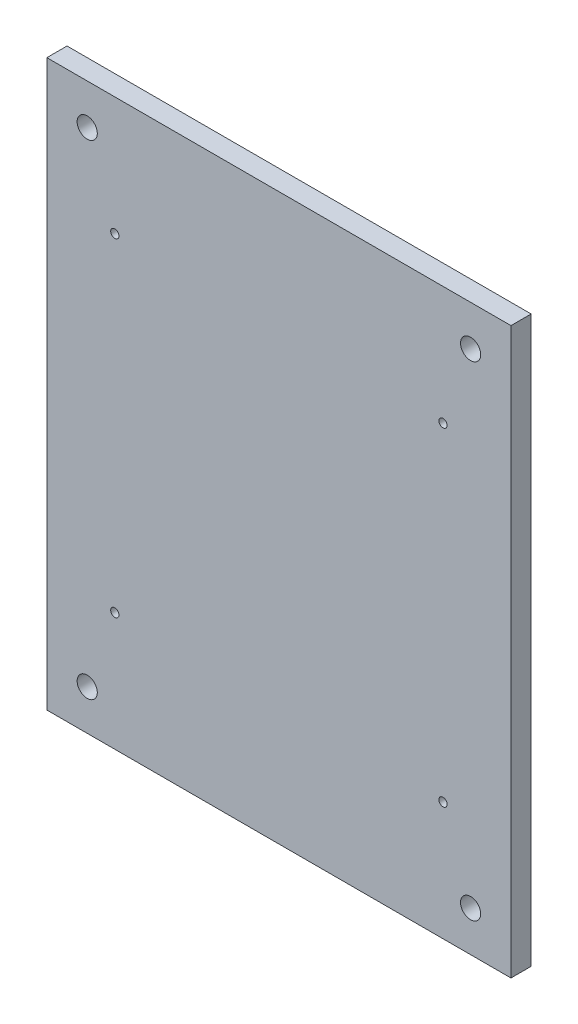
ISO-10303-21;
HEADER;
FILE_DESCRIPTION(('STEP AP214'),'2;1');
FILE_NAME('part.step','',(''),(''),'','','');
FILE_SCHEMA(('AUTOMOTIVE_DESIGN { 1 0 10303 214 1 1 1 1 }'));
ENDSEC;
DATA;
#1=APPLICATION_CONTEXT('core data for automotive mechanical design processes');
#2=APPLICATION_PROTOCOL_DEFINITION('international standard','automotive_design',2000,#1);
#3=PRODUCT_CONTEXT('',#1,'mechanical');
#4=PRODUCT('Part','Part','',(#3));
#5=PRODUCT_RELATED_PRODUCT_CATEGORY('part','',(#4));
#6=PRODUCT_DEFINITION_FORMATION('','',#4);
#7=PRODUCT_DEFINITION_CONTEXT('part definition',#1,'design');
#8=PRODUCT_DEFINITION('design','',#6,#7);
#9=PRODUCT_DEFINITION_SHAPE('','',#8);
#10=(LENGTH_UNIT() NAMED_UNIT(*) SI_UNIT(.MILLI.,.METRE.));
#11=(NAMED_UNIT(*) PLANE_ANGLE_UNIT() SI_UNIT($,.RADIAN.));
#12=(NAMED_UNIT(*) SI_UNIT($,.STERADIAN.) SOLID_ANGLE_UNIT());
#13=UNCERTAINTY_MEASURE_WITH_UNIT(LENGTH_MEASURE(1.E-05),#10,'distance_accuracy_value','');
#14=(GEOMETRIC_REPRESENTATION_CONTEXT(3) GLOBAL_UNCERTAINTY_ASSIGNED_CONTEXT((#13)) GLOBAL_UNIT_ASSIGNED_CONTEXT((#10,
#11,#12)) REPRESENTATION_CONTEXT('',''));
#15=CARTESIAN_POINT('',(0.,0.,0.));
#16=DIRECTION('',(0.,0.,1.));
#17=DIRECTION('',(1.,0.,0.));
#18=AXIS2_PLACEMENT_3D('',#15,#16,#17);
#19=CARTESIAN_POINT('',(4.,4.,0.));
#20=DIRECTION('',(0.,0.,-1.));
#21=DIRECTION('',(-1.,0.,0.));
#22=AXIS2_PLACEMENT_3D('',#19,#20,#21);
#23=PLANE('',#22);
#24=CARTESIAN_POINT('',(6.59000000000001,6.59,0.));
#25=DIRECTION('',(0.,0.,1.));
#26=DIRECTION('',(1.,0.,0.));
#27=AXIS2_PLACEMENT_3D('',#24,#25,#26);
#28=CIRCLE('',#27,1.025);
#29=CARTESIAN_POINT('',(7.61500000000001,6.59,0.));
#30=VERTEX_POINT('',#29);
#31=EDGE_CURVE('E225',#30,#30,#28,.T.);
#32=ORIENTED_EDGE('',*,*,#31,.T.);
#33=EDGE_LOOP('',(#32));
#34=FACE_BOUND('',#33,.T.);
#35=CARTESIAN_POINT('',(6.59000000000001,87.91,0.));
#36=DIRECTION('',(0.,0.,1.));
#37=DIRECTION('',(1.,0.,0.));
#38=AXIS2_PLACEMENT_3D('',#35,#36,#37);
#39=CIRCLE('',#38,1.025);
#40=CARTESIAN_POINT('',(7.61500000000001,87.91,0.));
#41=VERTEX_POINT('',#40);
#42=EDGE_CURVE('E169',#41,#41,#39,.T.);
#43=ORIENTED_EDGE('',*,*,#42,.T.);
#44=EDGE_LOOP('',(#43));
#45=FACE_BOUND('',#44,.T.);
#46=CARTESIAN_POINT('',(4.,4.,0.));
#47=DIRECTION('',(0.,0.,1.));
#48=DIRECTION('',(-1.,0.,0.));
#49=AXIS2_PLACEMENT_3D('',#46,#47,#48);
#50=CIRCLE('',#49,4.);
#51=CARTESIAN_POINT('',(0.,4.00000000000003,0.));
#52=VERTEX_POINT('',#51);
#53=CARTESIAN_POINT('',(4.00000000000003,0.,0.));
#54=VERTEX_POINT('',#53);
#55=EDGE_CURVE('E164',#52,#54,#50,.T.);
#56=ORIENTED_EDGE('',*,*,#55,.F.);
#57=DIRECTION('',(0.,-1.,0.));
#58=VECTOR('',#57,1.);
#59=CARTESIAN_POINT('',(0.,4.00000000000003,0.));
#60=LINE('',#59,#58);
#61=CARTESIAN_POINT('',(0.,90.5,0.));
#62=VERTEX_POINT('',#61);
#63=EDGE_CURVE('E99',#62,#52,#60,.T.);
#64=ORIENTED_EDGE('',*,*,#63,.F.);
#65=CARTESIAN_POINT('',(4.,90.5,0.));
#66=DIRECTION('',(0.,0.,1.));
#67=DIRECTION('',(-1.,0.,0.));
#68=AXIS2_PLACEMENT_3D('',#65,#66,#67);
#69=CIRCLE('',#68,4.);
#70=CARTESIAN_POINT('',(4.00000000000003,94.5,0.));
#71=VERTEX_POINT('',#70);
#72=EDGE_CURVE('E93',#71,#62,#69,.T.);
#73=ORIENTED_EDGE('',*,*,#72,.F.);
#74=DIRECTION('',(-1.,0.,0.));
#75=VECTOR('',#74,1.);
#76=CARTESIAN_POINT('',(4.00000000000003,94.5,0.));
#77=LINE('',#76,#75);
#78=CARTESIAN_POINT('',(90.5,94.5,0.));
#79=VERTEX_POINT('',#78);
#80=EDGE_CURVE('E180',#79,#71,#77,.T.);
#81=ORIENTED_EDGE('',*,*,#80,.F.);
#82=CARTESIAN_POINT('',(90.5,90.5,0.));
#83=DIRECTION('',(0.,0.,1.));
#84=DIRECTION('',(-1.,0.,0.));
#85=AXIS2_PLACEMENT_3D('',#82,#83,#84);
#86=CIRCLE('',#85,4.);
#87=CARTESIAN_POINT('',(94.5,90.5,0.));
#88=VERTEX_POINT('',#87);
#89=EDGE_CURVE('E130',#88,#79,#86,.T.);
#90=ORIENTED_EDGE('',*,*,#89,.F.);
#91=DIRECTION('',(0.,1.,0.));
#92=VECTOR('',#91,1.);
#93=CARTESIAN_POINT('',(94.5,4.00000000000003,0.));
#94=LINE('',#93,#92);
#95=CARTESIAN_POINT('',(94.5,4.,0.));
#96=VERTEX_POINT('',#95);
#97=EDGE_CURVE('E175',#96,#88,#94,.T.);
#98=ORIENTED_EDGE('',*,*,#97,.F.);
#99=CARTESIAN_POINT('',(90.5,4.,0.));
#100=DIRECTION('',(0.,0.,1.));
#101=DIRECTION('',(1.,0.,0.));
#102=AXIS2_PLACEMENT_3D('',#99,#100,#101);
#103=CIRCLE('',#102,4.);
#104=CARTESIAN_POINT('',(90.5,0.,0.));
#105=VERTEX_POINT('',#104);
#106=EDGE_CURVE('E172',#105,#96,#103,.T.);
#107=ORIENTED_EDGE('',*,*,#106,.F.);
#108=DIRECTION('',(1.,0.,0.));
#109=VECTOR('',#108,1.);
#110=CARTESIAN_POINT('',(4.00000000000003,0.,0.));
#111=LINE('',#110,#109);
#112=EDGE_CURVE('E168',#54,#105,#111,.T.);
#113=ORIENTED_EDGE('',*,*,#112,.F.);
#114=EDGE_LOOP('',(#56,#64,#73,#81,#90,#98,#107,#113));
#115=FACE_BOUND('',#114,.T.);
#116=CARTESIAN_POINT('',(87.91,87.91,0.));
#117=DIRECTION('',(0.,0.,1.));
#118=DIRECTION('',(1.,0.,0.));
#119=AXIS2_PLACEMENT_3D('',#116,#117,#118);
#120=CIRCLE('',#119,1.025);
#121=CARTESIAN_POINT('',(88.935,87.91,0.));
#122=VERTEX_POINT('',#121);
#123=EDGE_CURVE('E221',#122,#122,#120,.T.);
#124=ORIENTED_EDGE('',*,*,#123,.T.);
#125=EDGE_LOOP('',(#124));
#126=FACE_BOUND('',#125,.T.);
#127=CARTESIAN_POINT('',(87.91,6.59,0.));
#128=DIRECTION('',(0.,0.,1.));
#129=DIRECTION('',(1.,0.,0.));
#130=AXIS2_PLACEMENT_3D('',#127,#128,#129);
#131=CIRCLE('',#130,1.025);
#132=CARTESIAN_POINT('',(88.935,6.59,0.));
#133=VERTEX_POINT('',#132);
#134=EDGE_CURVE('E229',#133,#133,#131,.T.);
#135=ORIENTED_EDGE('',*,*,#134,.T.);
#136=EDGE_LOOP('',(#135));
#137=FACE_BOUND('',#136,.T.);
#138=ADVANCED_FACE('F47',(#34,#45,#115,#126,#137),#23,.T.);
#139=CARTESIAN_POINT('',(4.,4.,5.));
#140=DIRECTION('',(0.,0.,-1.));
#141=DIRECTION('',(-1.,0.,0.));
#142=AXIS2_PLACEMENT_3D('',#139,#140,#141);
#143=CYLINDRICAL_SURFACE('',#142,4.);
#144=ORIENTED_EDGE('',*,*,#55,.T.);
#145=DIRECTION('',(0.,0.,-1.));
#146=VECTOR('',#145,1.);
#147=CARTESIAN_POINT('',(4.00000000000003,0.,5.));
#148=LINE('',#147,#146);
#149=CARTESIAN_POINT('',(4.00000000000003,0.,5.));
#150=VERTEX_POINT('',#149);
#151=EDGE_CURVE('E12',#150,#54,#148,.T.);
#152=ORIENTED_EDGE('',*,*,#151,.F.);
#153=CARTESIAN_POINT('',(4.,4.,5.));
#154=DIRECTION('',(0.,0.,1.));
#155=DIRECTION('',(-1.,0.,0.));
#156=AXIS2_PLACEMENT_3D('',#153,#154,#155);
#157=CIRCLE('',#156,4.);
#158=CARTESIAN_POINT('',(0.,4.00000000000003,5.));
#159=VERTEX_POINT('',#158);
#160=EDGE_CURVE('E187',#159,#150,#157,.T.);
#161=ORIENTED_EDGE('',*,*,#160,.F.);
#162=DIRECTION('',(0.,0.,-1.));
#163=VECTOR('',#162,1.);
#164=CARTESIAN_POINT('',(0.,4.00000000000003,5.));
#165=LINE('',#164,#163);
#166=EDGE_CURVE('E163',#159,#52,#165,.T.);
#167=ORIENTED_EDGE('',*,*,#166,.T.);
#168=EDGE_LOOP('',(#144,#152,#161,#167));
#169=FACE_BOUND('',#168,.T.);
#170=ADVANCED_FACE('F49',(#169),#143,.T.);
#171=CARTESIAN_POINT('',(4.00000000000003,0.,5.));
#172=DIRECTION('',(0.,1.,0.));
#173=DIRECTION('',(0.,0.,1.));
#174=AXIS2_PLACEMENT_3D('',#171,#172,#173);
#175=PLANE('',#174);
#176=ORIENTED_EDGE('',*,*,#112,.T.);
#177=DIRECTION('',(0.,0.,-1.));
#178=VECTOR('',#177,1.);
#179=CARTESIAN_POINT('',(90.5,0.,5.));
#180=LINE('',#179,#178);
#181=CARTESIAN_POINT('',(90.5,0.,5.));
#182=VERTEX_POINT('',#181);
#183=EDGE_CURVE('E57',#182,#105,#180,.T.);
#184=ORIENTED_EDGE('',*,*,#183,.F.);
#185=DIRECTION('',(1.,0.,0.));
#186=VECTOR('',#185,1.);
#187=CARTESIAN_POINT('',(4.00000000000003,0.,5.));
#188=LINE('',#187,#186);
#189=EDGE_CURVE('E107',#150,#182,#188,.T.);
#190=ORIENTED_EDGE('',*,*,#189,.F.);
#191=ORIENTED_EDGE('',*,*,#151,.T.);
#192=EDGE_LOOP('',(#176,#184,#190,#191));
#193=FACE_BOUND('',#192,.T.);
#194=ADVANCED_FACE('F376',(#193),#175,.F.);
#195=CARTESIAN_POINT('',(90.5,4.,5.));
#196=DIRECTION('',(0.,0.,-1.));
#197=DIRECTION('',(-1.,0.,0.));
#198=AXIS2_PLACEMENT_3D('',#195,#196,#197);
#199=CYLINDRICAL_SURFACE('',#198,4.);
#200=ORIENTED_EDGE('',*,*,#106,.T.);
#201=DIRECTION('',(0.,0.,-1.));
#202=VECTOR('',#201,1.);
#203=CARTESIAN_POINT('',(94.5,4.,5.));
#204=LINE('',#203,#202);
#205=CARTESIAN_POINT('',(94.5,4.,5.));
#206=VERTEX_POINT('',#205);
#207=EDGE_CURVE('E196',#206,#96,#204,.T.);
#208=ORIENTED_EDGE('',*,*,#207,.F.);
#209=CARTESIAN_POINT('',(90.5,4.,5.));
#210=DIRECTION('',(0.,0.,1.));
#211=DIRECTION('',(1.,0.,0.));
#212=AXIS2_PLACEMENT_3D('',#209,#210,#211);
#213=CIRCLE('',#212,4.);
#214=EDGE_CURVE('E154',#182,#206,#213,.T.);
#215=ORIENTED_EDGE('',*,*,#214,.F.);
#216=ORIENTED_EDGE('',*,*,#183,.T.);
#217=EDGE_LOOP('',(#200,#208,#215,#216));
#218=FACE_BOUND('',#217,.T.);
#219=ADVANCED_FACE('F204',(#218),#199,.T.);
#220=CARTESIAN_POINT('',(94.5,4.00000000000003,5.));
#221=DIRECTION('',(-1.,0.,0.));
#222=DIRECTION('',(0.,0.,1.));
#223=AXIS2_PLACEMENT_3D('',#220,#221,#222);
#224=PLANE('',#223);
#225=ORIENTED_EDGE('',*,*,#97,.T.);
#226=DIRECTION('',(0.,0.,-1.));
#227=VECTOR('',#226,1.);
#228=CARTESIAN_POINT('',(94.5,90.5,5.));
#229=LINE('',#228,#227);
#230=CARTESIAN_POINT('',(94.5,90.5,5.));
#231=VERTEX_POINT('',#230);
#232=EDGE_CURVE('E134',#231,#88,#229,.T.);
#233=ORIENTED_EDGE('',*,*,#232,.F.);
#234=DIRECTION('',(0.,1.,0.));
#235=VECTOR('',#234,1.);
#236=CARTESIAN_POINT('',(94.5,4.00000000000003,5.));
#237=LINE('',#236,#235);
#238=EDGE_CURVE('E150',#206,#231,#237,.T.);
#239=ORIENTED_EDGE('',*,*,#238,.F.);
#240=ORIENTED_EDGE('',*,*,#207,.T.);
#241=EDGE_LOOP('',(#225,#233,#239,#240));
#242=FACE_BOUND('',#241,.T.);
#243=ADVANCED_FACE('F210',(#242),#224,.F.);
#244=CARTESIAN_POINT('',(90.5,90.5,5.));
#245=DIRECTION('',(0.,0.,-1.));
#246=DIRECTION('',(-1.,0.,0.));
#247=AXIS2_PLACEMENT_3D('',#244,#245,#246);
#248=CYLINDRICAL_SURFACE('',#247,4.);
#249=ORIENTED_EDGE('',*,*,#89,.T.);
#250=DIRECTION('',(0.,0.,-1.));
#251=VECTOR('',#250,1.);
#252=CARTESIAN_POINT('',(90.5,94.5,5.));
#253=LINE('',#252,#251);
#254=CARTESIAN_POINT('',(90.5,94.5,5.));
#255=VERTEX_POINT('',#254);
#256=EDGE_CURVE('E122',#255,#79,#253,.T.);
#257=ORIENTED_EDGE('',*,*,#256,.F.);
#258=CARTESIAN_POINT('',(90.5,90.5,5.));
#259=DIRECTION('',(0.,0.,1.));
#260=DIRECTION('',(-1.,0.,0.));
#261=AXIS2_PLACEMENT_3D('',#258,#259,#260);
#262=CIRCLE('',#261,4.);
#263=EDGE_CURVE('E127',#231,#255,#262,.T.);
#264=ORIENTED_EDGE('',*,*,#263,.F.);
#265=ORIENTED_EDGE('',*,*,#232,.T.);
#266=EDGE_LOOP('',(#249,#257,#264,#265));
#267=FACE_BOUND('',#266,.T.);
#268=ADVANCED_FACE('F124',(#267),#248,.T.);
#269=CARTESIAN_POINT('',(4.00000000000003,94.5,5.));
#270=DIRECTION('',(0.,-1.,0.));
#271=DIRECTION('',(0.,0.,-1.));
#272=AXIS2_PLACEMENT_3D('',#269,#270,#271);
#273=PLANE('',#272);
#274=ORIENTED_EDGE('',*,*,#80,.T.);
#275=DIRECTION('',(0.,0.,-1.));
#276=VECTOR('',#275,1.);
#277=CARTESIAN_POINT('',(4.00000000000003,94.5,5.));
#278=LINE('',#277,#276);
#279=CARTESIAN_POINT('',(4.00000000000003,94.5,5.));
#280=VERTEX_POINT('',#279);
#281=EDGE_CURVE('E135',#280,#71,#278,.T.);
#282=ORIENTED_EDGE('',*,*,#281,.F.);
#283=DIRECTION('',(-1.,0.,0.));
#284=VECTOR('',#283,1.);
#285=CARTESIAN_POINT('',(4.00000000000003,94.5,5.));
#286=LINE('',#285,#284);
#287=EDGE_CURVE('E138',#255,#280,#286,.T.);
#288=ORIENTED_EDGE('',*,*,#287,.F.);
#289=ORIENTED_EDGE('',*,*,#256,.T.);
#290=EDGE_LOOP('',(#274,#282,#288,#289));
#291=FACE_BOUND('',#290,.T.);
#292=ADVANCED_FACE('F139',(#291),#273,.F.);
#293=CARTESIAN_POINT('',(4.,90.5,5.));
#294=DIRECTION('',(0.,0.,-1.));
#295=DIRECTION('',(-1.,0.,0.));
#296=AXIS2_PLACEMENT_3D('',#293,#294,#295);
#297=CYLINDRICAL_SURFACE('',#296,4.);
#298=ORIENTED_EDGE('',*,*,#72,.T.);
#299=DIRECTION('',(0.,0.,-1.));
#300=VECTOR('',#299,1.);
#301=CARTESIAN_POINT('',(0.,90.5,5.));
#302=LINE('',#301,#300);
#303=CARTESIAN_POINT('',(0.,90.5,5.));
#304=VERTEX_POINT('',#303);
#305=EDGE_CURVE('E65',#304,#62,#302,.T.);
#306=ORIENTED_EDGE('',*,*,#305,.F.);
#307=CARTESIAN_POINT('',(4.,90.5,5.));
#308=DIRECTION('',(0.,0.,1.));
#309=DIRECTION('',(-1.,0.,0.));
#310=AXIS2_PLACEMENT_3D('',#307,#308,#309);
#311=CIRCLE('',#310,4.);
#312=EDGE_CURVE('E143',#280,#304,#311,.T.);
#313=ORIENTED_EDGE('',*,*,#312,.F.);
#314=ORIENTED_EDGE('',*,*,#281,.T.);
#315=EDGE_LOOP('',(#298,#306,#313,#314));
#316=FACE_BOUND('',#315,.T.);
#317=ADVANCED_FACE('F385',(#316),#297,.T.);
#318=CARTESIAN_POINT('',(0.,4.00000000000003,5.));
#319=DIRECTION('',(1.,0.,0.));
#320=DIRECTION('',(0.,0.,-1.));
#321=AXIS2_PLACEMENT_3D('',#318,#319,#320);
#322=PLANE('',#321);
#323=ORIENTED_EDGE('',*,*,#63,.T.);
#324=ORIENTED_EDGE('',*,*,#166,.F.);
#325=DIRECTION('',(0.,-1.,0.));
#326=VECTOR('',#325,1.);
#327=CARTESIAN_POINT('',(0.,4.00000000000003,5.));
#328=LINE('',#327,#326);
#329=EDGE_CURVE('E160',#304,#159,#328,.T.);
#330=ORIENTED_EDGE('',*,*,#329,.F.);
#331=ORIENTED_EDGE('',*,*,#305,.T.);
#332=EDGE_LOOP('',(#323,#324,#330,#331));
#333=FACE_BOUND('',#332,.T.);
#334=ADVANCED_FACE('F383',(#333),#322,.F.);
#335=CARTESIAN_POINT('',(6.59000000000001,87.91,5.));
#336=DIRECTION('',(0.,0.,-1.));
#337=DIRECTION('',(-1.,0.,0.));
#338=AXIS2_PLACEMENT_3D('',#335,#336,#337);
#339=CYLINDRICAL_SURFACE('',#338,1.025);
#340=ORIENTED_EDGE('',*,*,#42,.F.);
#341=EDGE_LOOP('',(#340));
#342=FACE_BOUND('',#341,.T.);
#343=CARTESIAN_POINT('',(6.59000000000001,87.91,10.));
#344=DIRECTION('',(0.,0.,1.));
#345=DIRECTION('',(1.,0.,0.));
#346=AXIS2_PLACEMENT_3D('',#343,#344,#345);
#347=CIRCLE('',#346,1.025);
#348=CARTESIAN_POINT('',(7.61500000000001,87.91,10.));
#349=VERTEX_POINT('',#348);
#350=EDGE_CURVE('E322',#349,#349,#347,.T.);
#351=ORIENTED_EDGE('',*,*,#350,.T.);
#352=EDGE_LOOP('',(#351));
#353=FACE_BOUND('',#352,.T.);
#354=ADVANCED_FACE('F381',(#342,#353),#339,.F.);
#355=CARTESIAN_POINT('',(87.91,87.91,5.));
#356=DIRECTION('',(0.,0.,-1.));
#357=DIRECTION('',(-1.,0.,0.));
#358=AXIS2_PLACEMENT_3D('',#355,#356,#357);
#359=CYLINDRICAL_SURFACE('',#358,1.025);
#360=ORIENTED_EDGE('',*,*,#123,.F.);
#361=EDGE_LOOP('',(#360));
#362=FACE_BOUND('',#361,.T.);
#363=CARTESIAN_POINT('',(87.91,87.91,10.));
#364=DIRECTION('',(0.,0.,1.));
#365=DIRECTION('',(1.,0.,0.));
#366=AXIS2_PLACEMENT_3D('',#363,#364,#365);
#367=CIRCLE('',#366,1.025);
#368=CARTESIAN_POINT('',(88.935,87.91,10.));
#369=VERTEX_POINT('',#368);
#370=EDGE_CURVE('E318',#369,#369,#367,.T.);
#371=ORIENTED_EDGE('',*,*,#370,.T.);
#372=EDGE_LOOP('',(#371));
#373=FACE_BOUND('',#372,.T.);
#374=ADVANCED_FACE('F463',(#362,#373),#359,.F.);
#375=CARTESIAN_POINT('',(6.59000000000001,6.59,5.));
#376=DIRECTION('',(0.,0.,-1.));
#377=DIRECTION('',(-1.,0.,0.));
#378=AXIS2_PLACEMENT_3D('',#375,#376,#377);
#379=CYLINDRICAL_SURFACE('',#378,1.025);
#380=ORIENTED_EDGE('',*,*,#31,.F.);
#381=EDGE_LOOP('',(#380));
#382=FACE_BOUND('',#381,.T.);
#383=CARTESIAN_POINT('',(6.59000000000001,6.59,10.));
#384=DIRECTION('',(0.,0.,1.));
#385=DIRECTION('',(1.,0.,0.));
#386=AXIS2_PLACEMENT_3D('',#383,#384,#385);
#387=CIRCLE('',#386,1.025);
#388=CARTESIAN_POINT('',(7.61500000000001,6.59,10.));
#389=VERTEX_POINT('',#388);
#390=EDGE_CURVE('E317',#389,#389,#387,.T.);
#391=ORIENTED_EDGE('',*,*,#390,.T.);
#392=EDGE_LOOP('',(#391));
#393=FACE_BOUND('',#392,.T.);
#394=ADVANCED_FACE('F330',(#382,#393),#379,.F.);
#395=CARTESIAN_POINT('',(87.91,6.59,5.));
#396=DIRECTION('',(0.,0.,-1.));
#397=DIRECTION('',(-1.,0.,0.));
#398=AXIS2_PLACEMENT_3D('',#395,#396,#397);
#399=CYLINDRICAL_SURFACE('',#398,1.025);
#400=ORIENTED_EDGE('',*,*,#134,.F.);
#401=EDGE_LOOP('',(#400));
#402=FACE_BOUND('',#401,.T.);
#403=CARTESIAN_POINT('',(87.91,6.59,10.));
#404=DIRECTION('',(0.,0.,1.));
#405=DIRECTION('',(1.,0.,0.));
#406=AXIS2_PLACEMENT_3D('',#403,#404,#405);
#407=CIRCLE('',#406,1.025);
#408=CARTESIAN_POINT('',(88.935,6.59,10.));
#409=VERTEX_POINT('',#408);
#410=EDGE_CURVE('E310',#409,#409,#407,.T.);
#411=ORIENTED_EDGE('',*,*,#410,.T.);
#412=EDGE_LOOP('',(#411));
#413=FACE_BOUND('',#412,.T.);
#414=ADVANCED_FACE('F335',(#402,#413),#399,.F.);
#415=CARTESIAN_POINT('',(0.,0.,10.));
#416=DIRECTION('',(0.,0.,1.));
#417=DIRECTION('',(1.,0.,0.));
#418=AXIS2_PLACEMENT_3D('',#415,#416,#417);
#419=PLANE('',#418);
#420=ORIENTED_EDGE('',*,*,#370,.F.);
#421=EDGE_LOOP('',(#420));
#422=FACE_BOUND('',#421,.T.);
#423=ORIENTED_EDGE('',*,*,#350,.F.);
#424=EDGE_LOOP('',(#423));
#425=FACE_BOUND('',#424,.T.);
#426=ORIENTED_EDGE('',*,*,#390,.F.);
#427=EDGE_LOOP('',(#426));
#428=FACE_BOUND('',#427,.T.);
#429=ORIENTED_EDGE('',*,*,#410,.F.);
#430=EDGE_LOOP('',(#429));
#431=FACE_BOUND('',#430,.T.);
#432=CARTESIAN_POINT('',(-0.249999999999968,107.25,10.));
#433=DIRECTION('',(0.,0.,1.));
#434=DIRECTION('',(1.,0.,0.));
#435=AXIS2_PLACEMENT_3D('',#432,#433,#434);
#436=CIRCLE('',#435,2.50000000000001);
#437=CARTESIAN_POINT('',(2.25000000000004,107.25,10.));
#438=VERTEX_POINT('',#437);
#439=EDGE_CURVE('E294',#438,#438,#436,.T.);
#440=ORIENTED_EDGE('',*,*,#439,.F.);
#441=EDGE_LOOP('',(#440));
#442=FACE_BOUND('',#441,.T.);
#443=CARTESIAN_POINT('',(94.75,107.25,10.));
#444=DIRECTION('',(0.,0.,1.));
#445=DIRECTION('',(1.,0.,0.));
#446=AXIS2_PLACEMENT_3D('',#443,#444,#445);
#447=CIRCLE('',#446,2.50000000000001);
#448=CARTESIAN_POINT('',(97.25,107.25,10.));
#449=VERTEX_POINT('',#448);
#450=EDGE_CURVE('E267',#449,#449,#447,.T.);
#451=ORIENTED_EDGE('',*,*,#450,.F.);
#452=EDGE_LOOP('',(#451));
#453=FACE_BOUND('',#452,.T.);
#454=DIRECTION('',(0.,-1.,0.));
#455=VECTOR('',#454,1.);
#456=CARTESIAN_POINT('',(-10.25,117.25,10.));
#457=LINE('',#456,#455);
#458=CARTESIAN_POINT('',(-10.25,117.25,10.));
#459=VERTEX_POINT('',#458);
#460=CARTESIAN_POINT('',(-10.25,-22.75,10.));
#461=VERTEX_POINT('',#460);
#462=EDGE_CURVE('E254',#459,#461,#457,.T.);
#463=ORIENTED_EDGE('',*,*,#462,.T.);
#464=DIRECTION('',(1.,0.,0.));
#465=VECTOR('',#464,1.);
#466=CARTESIAN_POINT('',(-10.25,-22.75,10.));
#467=LINE('',#466,#465);
#468=CARTESIAN_POINT('',(104.75,-22.75,10.));
#469=VERTEX_POINT('',#468);
#470=EDGE_CURVE('E275',#461,#469,#467,.T.);
#471=ORIENTED_EDGE('',*,*,#470,.T.);
#472=DIRECTION('',(0.,1.,0.));
#473=VECTOR('',#472,1.);
#474=CARTESIAN_POINT('',(104.75,117.25,10.));
#475=LINE('',#474,#473);
#476=CARTESIAN_POINT('',(104.75,117.25,10.));
#477=VERTEX_POINT('',#476);
#478=EDGE_CURVE('E271',#469,#477,#475,.T.);
#479=ORIENTED_EDGE('',*,*,#478,.T.);
#480=DIRECTION('',(-1.,0.,0.));
#481=VECTOR('',#480,1.);
#482=CARTESIAN_POINT('',(-10.25,117.25,10.));
#483=LINE('',#482,#481);
#484=EDGE_CURVE('E249',#477,#459,#483,.T.);
#485=ORIENTED_EDGE('',*,*,#484,.T.);
#486=EDGE_LOOP('',(#463,#471,#479,#485));
#487=FACE_BOUND('',#486,.T.);
#488=CARTESIAN_POINT('',(94.75,-12.75,10.));
#489=DIRECTION('',(0.,0.,1.));
#490=DIRECTION('',(1.,0.,0.));
#491=AXIS2_PLACEMENT_3D('',#488,#489,#490);
#492=CIRCLE('',#491,2.5);
#493=CARTESIAN_POINT('',(97.25,-12.75,10.));
#494=VERTEX_POINT('',#493);
#495=EDGE_CURVE('E286',#494,#494,#492,.T.);
#496=ORIENTED_EDGE('',*,*,#495,.F.);
#497=EDGE_LOOP('',(#496));
#498=FACE_BOUND('',#497,.T.);
#499=CARTESIAN_POINT('',(-0.24999999999999,-12.75,10.));
#500=DIRECTION('',(0.,0.,1.));
#501=DIRECTION('',(1.,0.,0.));
#502=AXIS2_PLACEMENT_3D('',#499,#500,#501);
#503=CIRCLE('',#502,2.50000000000001);
#504=CARTESIAN_POINT('',(2.25000000000002,-12.75,10.));
#505=VERTEX_POINT('',#504);
#506=EDGE_CURVE('E302',#505,#505,#503,.T.);
#507=ORIENTED_EDGE('',*,*,#506,.F.);
#508=EDGE_LOOP('',(#507));
#509=FACE_BOUND('',#508,.T.);
#510=ADVANCED_FACE('F332',(#422,#425,#428,#431,#442,#453,#487,#498,#509),#419,.T.);
#511=CARTESIAN_POINT('',(0.,0.,5.));
#512=DIRECTION('',(0.,0.,1.));
#513=DIRECTION('',(1.,0.,0.));
#514=AXIS2_PLACEMENT_3D('',#511,#512,#513);
#515=PLANE('',#514);
#516=ORIENTED_EDGE('',*,*,#329,.T.);
#517=ORIENTED_EDGE('',*,*,#160,.T.);
#518=ORIENTED_EDGE('',*,*,#189,.T.);
#519=ORIENTED_EDGE('',*,*,#214,.T.);
#520=ORIENTED_EDGE('',*,*,#238,.T.);
#521=ORIENTED_EDGE('',*,*,#263,.T.);
#522=ORIENTED_EDGE('',*,*,#287,.T.);
#523=ORIENTED_EDGE('',*,*,#312,.T.);
#524=EDGE_LOOP('',(#516,#517,#518,#519,#520,#521,#522,#523));
#525=FACE_BOUND('',#524,.T.);
#526=DIRECTION('',(0.,-1.,0.));
#527=VECTOR('',#526,1.);
#528=CARTESIAN_POINT('',(-10.25,117.25,5.));
#529=LINE('',#528,#527);
#530=CARTESIAN_POINT('',(-10.25,117.25,5.));
#531=VERTEX_POINT('',#530);
#532=CARTESIAN_POINT('',(-10.25,-22.75,5.));
#533=VERTEX_POINT('',#532);
#534=EDGE_CURVE('E263',#531,#533,#529,.T.);
#535=ORIENTED_EDGE('',*,*,#534,.F.);
#536=DIRECTION('',(-1.,0.,0.));
#537=VECTOR('',#536,1.);
#538=CARTESIAN_POINT('',(-10.25,117.25,5.));
#539=LINE('',#538,#537);
#540=CARTESIAN_POINT('',(104.75,117.25,5.));
#541=VERTEX_POINT('',#540);
#542=EDGE_CURVE('E250',#541,#531,#539,.T.);
#543=ORIENTED_EDGE('',*,*,#542,.F.);
#544=DIRECTION('',(0.,1.,0.));
#545=VECTOR('',#544,1.);
#546=CARTESIAN_POINT('',(104.75,117.25,5.));
#547=LINE('',#546,#545);
#548=CARTESIAN_POINT('',(104.75,-22.75,5.));
#549=VERTEX_POINT('',#548);
#550=EDGE_CURVE('E255',#549,#541,#547,.T.);
#551=ORIENTED_EDGE('',*,*,#550,.F.);
#552=DIRECTION('',(1.,0.,0.));
#553=VECTOR('',#552,1.);
#554=CARTESIAN_POINT('',(-10.25,-22.75,5.));
#555=LINE('',#554,#553);
#556=EDGE_CURVE('E259',#533,#549,#555,.T.);
#557=ORIENTED_EDGE('',*,*,#556,.F.);
#558=EDGE_LOOP('',(#535,#543,#551,#557));
#559=FACE_BOUND('',#558,.T.);
#560=CARTESIAN_POINT('',(94.75,107.25,5.));
#561=DIRECTION('',(0.,0.,1.));
#562=DIRECTION('',(1.,0.,0.));
#563=AXIS2_PLACEMENT_3D('',#560,#561,#562);
#564=CIRCLE('',#563,2.50000000000001);
#565=CARTESIAN_POINT('',(97.25,107.25,5.));
#566=VERTEX_POINT('',#565);
#567=EDGE_CURVE('E282',#566,#566,#564,.T.);
#568=ORIENTED_EDGE('',*,*,#567,.T.);
#569=EDGE_LOOP('',(#568));
#570=FACE_BOUND('',#569,.T.);
#571=CARTESIAN_POINT('',(94.75,-12.75,5.));
#572=DIRECTION('',(0.,0.,1.));
#573=DIRECTION('',(1.,0.,0.));
#574=AXIS2_PLACEMENT_3D('',#571,#572,#573);
#575=CIRCLE('',#574,2.5);
#576=CARTESIAN_POINT('',(97.25,-12.75,5.));
#577=VERTEX_POINT('',#576);
#578=EDGE_CURVE('E290',#577,#577,#575,.T.);
#579=ORIENTED_EDGE('',*,*,#578,.T.);
#580=EDGE_LOOP('',(#579));
#581=FACE_BOUND('',#580,.T.);
#582=CARTESIAN_POINT('',(-0.249999999999968,107.25,5.));
#583=DIRECTION('',(0.,0.,1.));
#584=DIRECTION('',(1.,0.,0.));
#585=AXIS2_PLACEMENT_3D('',#582,#583,#584);
#586=CIRCLE('',#585,2.50000000000001);
#587=CARTESIAN_POINT('',(2.25000000000004,107.25,5.));
#588=VERTEX_POINT('',#587);
#589=EDGE_CURVE('E298',#588,#588,#586,.T.);
#590=ORIENTED_EDGE('',*,*,#589,.T.);
#591=EDGE_LOOP('',(#590));
#592=FACE_BOUND('',#591,.T.);
#593=CARTESIAN_POINT('',(-0.24999999999999,-12.75,5.));
#594=DIRECTION('',(0.,0.,1.));
#595=DIRECTION('',(1.,0.,0.));
#596=AXIS2_PLACEMENT_3D('',#593,#594,#595);
#597=CIRCLE('',#596,2.50000000000001);
#598=CARTESIAN_POINT('',(2.25000000000002,-12.75,5.));
#599=VERTEX_POINT('',#598);
#600=EDGE_CURVE('E306',#599,#599,#597,.T.);
#601=ORIENTED_EDGE('',*,*,#600,.T.);
#602=EDGE_LOOP('',(#601));
#603=FACE_BOUND('',#602,.T.);
#604=ADVANCED_FACE('F146',(#525,#559,#570,#581,#592,#603),#515,.F.);
#605=CARTESIAN_POINT('',(-10.25,117.25,10.));
#606=DIRECTION('',(1.,0.,0.));
#607=DIRECTION('',(0.,1.,0.));
#608=AXIS2_PLACEMENT_3D('',#605,#606,#607);
#609=PLANE('',#608);
#610=ORIENTED_EDGE('',*,*,#534,.T.);
#611=DIRECTION('',(0.,0.,-1.));
#612=VECTOR('',#611,1.);
#613=CARTESIAN_POINT('',(-10.25,-22.75,10.));
#614=LINE('',#613,#612);
#615=EDGE_CURVE('E233',#461,#533,#614,.T.);
#616=ORIENTED_EDGE('',*,*,#615,.F.);
#617=ORIENTED_EDGE('',*,*,#462,.F.);
#618=DIRECTION('',(0.,0.,-1.));
#619=VECTOR('',#618,1.);
#620=CARTESIAN_POINT('',(-10.25,117.25,10.));
#621=LINE('',#620,#619);
#622=EDGE_CURVE('E245',#459,#531,#621,.T.);
#623=ORIENTED_EDGE('',*,*,#622,.T.);
#624=EDGE_LOOP('',(#610,#616,#617,#623));
#625=FACE_BOUND('',#624,.T.);
#626=ADVANCED_FACE('F360',(#625),#609,.F.);
#627=CARTESIAN_POINT('',(-10.25,-22.75,10.));
#628=DIRECTION('',(0.,1.,0.));
#629=DIRECTION('',(0.,0.,1.));
#630=AXIS2_PLACEMENT_3D('',#627,#628,#629);
#631=PLANE('',#630);
#632=ORIENTED_EDGE('',*,*,#556,.T.);
#633=DIRECTION('',(0.,0.,-1.));
#634=VECTOR('',#633,1.);
#635=CARTESIAN_POINT('',(104.75,-22.75,10.));
#636=LINE('',#635,#634);
#637=EDGE_CURVE('E237',#469,#549,#636,.T.);
#638=ORIENTED_EDGE('',*,*,#637,.F.);
#639=ORIENTED_EDGE('',*,*,#470,.F.);
#640=ORIENTED_EDGE('',*,*,#615,.T.);
#641=EDGE_LOOP('',(#632,#638,#639,#640));
#642=FACE_BOUND('',#641,.T.);
#643=ADVANCED_FACE('F366',(#642),#631,.F.);
#644=CARTESIAN_POINT('',(104.75,117.25,10.));
#645=DIRECTION('',(-1.,0.,0.));
#646=DIRECTION('',(0.,-1.,0.));
#647=AXIS2_PLACEMENT_3D('',#644,#645,#646);
#648=PLANE('',#647);
#649=ORIENTED_EDGE('',*,*,#550,.T.);
#650=DIRECTION('',(0.,0.,-1.));
#651=VECTOR('',#650,1.);
#652=CARTESIAN_POINT('',(104.75,117.25,10.));
#653=LINE('',#652,#651);
#654=EDGE_CURVE('E241',#477,#541,#653,.T.);
#655=ORIENTED_EDGE('',*,*,#654,.F.);
#656=ORIENTED_EDGE('',*,*,#478,.F.);
#657=ORIENTED_EDGE('',*,*,#637,.T.);
#658=EDGE_LOOP('',(#649,#655,#656,#657));
#659=FACE_BOUND('',#658,.T.);
#660=ADVANCED_FACE('F425',(#659),#648,.F.);
#661=CARTESIAN_POINT('',(-10.25,117.25,10.));
#662=DIRECTION('',(0.,-1.,0.));
#663=DIRECTION('',(0.,0.,-1.));
#664=AXIS2_PLACEMENT_3D('',#661,#662,#663);
#665=PLANE('',#664);
#666=ORIENTED_EDGE('',*,*,#542,.T.);
#667=ORIENTED_EDGE('',*,*,#622,.F.);
#668=ORIENTED_EDGE('',*,*,#484,.F.);
#669=ORIENTED_EDGE('',*,*,#654,.T.);
#670=EDGE_LOOP('',(#666,#667,#668,#669));
#671=FACE_BOUND('',#670,.T.);
#672=ADVANCED_FACE('F426',(#671),#665,.F.);
#673=CARTESIAN_POINT('',(94.75,107.25,10.));
#674=DIRECTION('',(0.,0.,-1.));
#675=DIRECTION('',(-1.,0.,0.));
#676=AXIS2_PLACEMENT_3D('',#673,#674,#675);
#677=CYLINDRICAL_SURFACE('',#676,2.50000000000001);
#678=ORIENTED_EDGE('',*,*,#450,.T.);
#679=EDGE_LOOP('',(#678));
#680=FACE_BOUND('',#679,.T.);
#681=ORIENTED_EDGE('',*,*,#567,.F.);
#682=EDGE_LOOP('',(#681));
#683=FACE_BOUND('',#682,.T.);
#684=ADVANCED_FACE('F442',(#680,#683),#677,.F.);
#685=CARTESIAN_POINT('',(94.75,-12.75,10.));
#686=DIRECTION('',(0.,0.,-1.));
#687=DIRECTION('',(-1.,0.,0.));
#688=AXIS2_PLACEMENT_3D('',#685,#686,#687);
#689=CYLINDRICAL_SURFACE('',#688,2.5);
#690=ORIENTED_EDGE('',*,*,#495,.T.);
#691=EDGE_LOOP('',(#690));
#692=FACE_BOUND('',#691,.T.);
#693=ORIENTED_EDGE('',*,*,#578,.F.);
#694=EDGE_LOOP('',(#693));
#695=FACE_BOUND('',#694,.T.);
#696=ADVANCED_FACE('F436',(#692,#695),#689,.F.);
#697=CARTESIAN_POINT('',(-0.249999999999968,107.25,10.));
#698=DIRECTION('',(0.,0.,-1.));
#699=DIRECTION('',(-1.,0.,0.));
#700=AXIS2_PLACEMENT_3D('',#697,#698,#699);
#701=CYLINDRICAL_SURFACE('',#700,2.50000000000001);
#702=ORIENTED_EDGE('',*,*,#439,.T.);
#703=EDGE_LOOP('',(#702));
#704=FACE_BOUND('',#703,.T.);
#705=ORIENTED_EDGE('',*,*,#589,.F.);
#706=EDGE_LOOP('',(#705));
#707=FACE_BOUND('',#706,.T.);
#708=ADVANCED_FACE('F355',(#704,#707),#701,.F.);
#709=CARTESIAN_POINT('',(-0.24999999999999,-12.75,10.));
#710=DIRECTION('',(0.,0.,-1.));
#711=DIRECTION('',(-1.,0.,0.));
#712=AXIS2_PLACEMENT_3D('',#709,#710,#711);
#713=CYLINDRICAL_SURFACE('',#712,2.50000000000001);
#714=ORIENTED_EDGE('',*,*,#506,.T.);
#715=EDGE_LOOP('',(#714));
#716=FACE_BOUND('',#715,.T.);
#717=ORIENTED_EDGE('',*,*,#600,.F.);
#718=EDGE_LOOP('',(#717));
#719=FACE_BOUND('',#718,.T.);
#720=ADVANCED_FACE('F352',(#716,#719),#713,.F.);
#721=CLOSED_SHELL('',(#138,#170,#194,#219,#243,#268,#292,#317,#334,#354,#374,#394,#414,#510,
#604,#626,#643,#660,#672,#684,#696,#708,#720));
#722=MANIFOLD_SOLID_BREP('B2',#721);
#723=ADVANCED_BREP_SHAPE_REPRESENTATION('',(#18,#722),#14);
#724=SHAPE_DEFINITION_REPRESENTATION(#9,#723);
ENDSEC;
END-ISO-10303-21;
